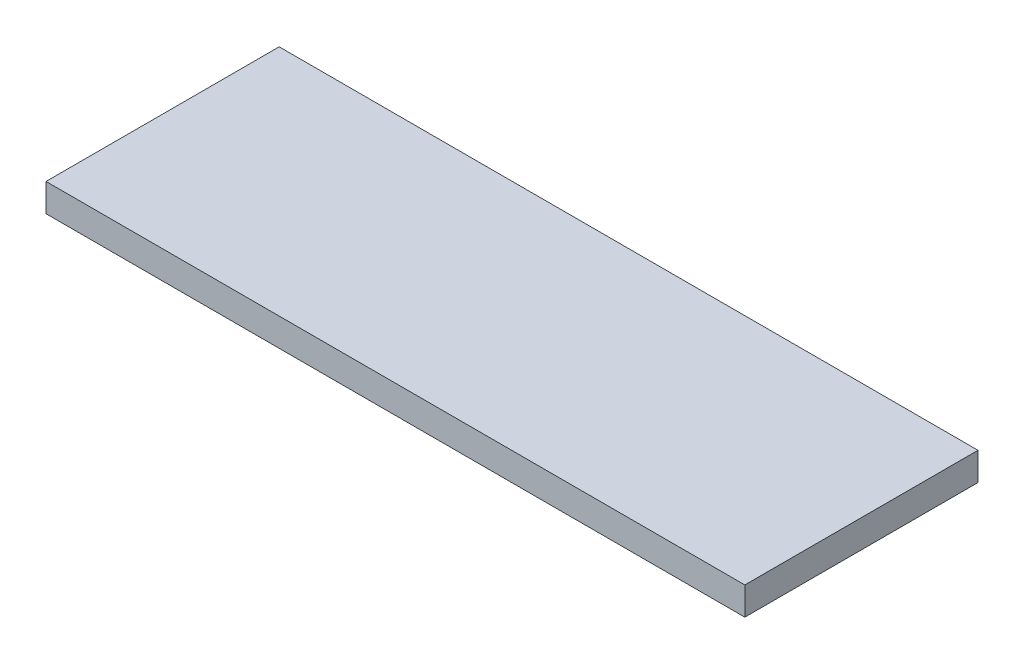
ISO-10303-21;
HEADER;
FILE_DESCRIPTION(('STEP AP214'),'2;1');
FILE_NAME('part.step','',(''),(''),'','','');
FILE_SCHEMA(('AUTOMOTIVE_DESIGN { 1 0 10303 214 1 1 1 1 }'));
ENDSEC;
DATA;
#1=APPLICATION_CONTEXT('core data for automotive mechanical design processes');
#2=APPLICATION_PROTOCOL_DEFINITION('international standard','automotive_design',2000,#1);
#3=PRODUCT_CONTEXT('',#1,'mechanical');
#4=PRODUCT('Part','Part','',(#3));
#5=PRODUCT_RELATED_PRODUCT_CATEGORY('part','',(#4));
#6=PRODUCT_DEFINITION_FORMATION('','',#4);
#7=PRODUCT_DEFINITION_CONTEXT('part definition',#1,'design');
#8=PRODUCT_DEFINITION('design','',#6,#7);
#9=PRODUCT_DEFINITION_SHAPE('','',#8);
#10=(LENGTH_UNIT() NAMED_UNIT(*) SI_UNIT(.MILLI.,.METRE.));
#11=(NAMED_UNIT(*) PLANE_ANGLE_UNIT() SI_UNIT($,.RADIAN.));
#12=(NAMED_UNIT(*) SI_UNIT($,.STERADIAN.) SOLID_ANGLE_UNIT());
#13=UNCERTAINTY_MEASURE_WITH_UNIT(LENGTH_MEASURE(1.E-05),#10,'distance_accuracy_value','');
#14=(GEOMETRIC_REPRESENTATION_CONTEXT(3) GLOBAL_UNCERTAINTY_ASSIGNED_CONTEXT((#13)) GLOBAL_UNIT_ASSIGNED_CONTEXT((#10,
#11,#12)) REPRESENTATION_CONTEXT('',''));
#15=CARTESIAN_POINT('',(0.,0.,0.));
#16=DIRECTION('',(0.,0.,1.));
#17=DIRECTION('',(1.,0.,0.));
#18=AXIS2_PLACEMENT_3D('',#15,#16,#17);
#19=CARTESIAN_POINT('',(0.,6.,0.));
#20=DIRECTION('',(-1.,0.,0.));
#21=DIRECTION('',(0.,0.,1.));
#22=AXIS2_PLACEMENT_3D('',#19,#20,#21);
#23=PLANE('',#22);
#24=DIRECTION('',(0.,0.,-1.));
#25=VECTOR('',#24,1.);
#26=CARTESIAN_POINT('',(0.,0.,0.));
#27=LINE('',#26,#25);
#28=CARTESIAN_POINT('',(0.,0.,0.));
#29=VERTEX_POINT('',#28);
#30=CARTESIAN_POINT('',(0.,0.,-50.05));
#31=VERTEX_POINT('',#30);
#32=EDGE_CURVE('E107',#29,#31,#27,.T.);
#33=ORIENTED_EDGE('',*,*,#32,.T.);
#34=DIRECTION('',(0.,-1.,0.));
#35=VECTOR('',#34,1.);
#36=CARTESIAN_POINT('',(0.,6.,-50.05));
#37=LINE('',#36,#35);
#38=CARTESIAN_POINT('',(0.,6.,-50.05));
#39=VERTEX_POINT('',#38);
#40=EDGE_CURVE('E11',#39,#31,#37,.T.);
#41=ORIENTED_EDGE('',*,*,#40,.F.);
#42=DIRECTION('',(0.,0.,-1.));
#43=VECTOR('',#42,1.);
#44=CARTESIAN_POINT('',(0.,6.,0.));
#45=LINE('',#44,#43);
#46=CARTESIAN_POINT('',(0.,6.,0.));
#47=VERTEX_POINT('',#46);
#48=EDGE_CURVE('E91',#47,#39,#45,.T.);
#49=ORIENTED_EDGE('',*,*,#48,.F.);
#50=DIRECTION('',(0.,-1.,0.));
#51=VECTOR('',#50,1.);
#52=CARTESIAN_POINT('',(0.,6.,0.));
#53=LINE('',#52,#51);
#54=EDGE_CURVE('E103',#47,#29,#53,.T.);
#55=ORIENTED_EDGE('',*,*,#54,.T.);
#56=EDGE_LOOP('',(#33,#41,#49,#55));
#57=FACE_BOUND('',#56,.T.);
#58=ADVANCED_FACE('F39',(#57),#23,.F.);
#59=CARTESIAN_POINT('',(0.,6.,-50.05));
#60=DIRECTION('',(0.,0.,1.));
#61=DIRECTION('',(1.,0.,0.));
#62=AXIS2_PLACEMENT_3D('',#59,#60,#61);
#63=PLANE('',#62);
#64=DIRECTION('',(-1.,0.,0.));
#65=VECTOR('',#64,1.);
#66=CARTESIAN_POINT('',(0.,0.,-50.05));
#67=LINE('',#66,#65);
#68=CARTESIAN_POINT('',(-150.,0.,-50.05));
#69=VERTEX_POINT('',#68);
#70=EDGE_CURVE('E96',#31,#69,#67,.T.);
#71=ORIENTED_EDGE('',*,*,#70,.T.);
#72=DIRECTION('',(0.,-1.,0.));
#73=VECTOR('',#72,1.);
#74=CARTESIAN_POINT('',(-150.,6.,-50.05));
#75=LINE('',#74,#73);
#76=CARTESIAN_POINT('',(-150.,6.,-50.05));
#77=VERTEX_POINT('',#76);
#78=EDGE_CURVE('E48',#77,#69,#75,.T.);
#79=ORIENTED_EDGE('',*,*,#78,.F.);
#80=DIRECTION('',(-1.,0.,0.));
#81=VECTOR('',#80,1.);
#82=CARTESIAN_POINT('',(0.,6.,-50.05));
#83=LINE('',#82,#81);
#84=EDGE_CURVE('E86',#39,#77,#83,.T.);
#85=ORIENTED_EDGE('',*,*,#84,.F.);
#86=ORIENTED_EDGE('',*,*,#40,.T.);
#87=EDGE_LOOP('',(#71,#79,#85,#86));
#88=FACE_BOUND('',#87,.T.);
#89=ADVANCED_FACE('F95',(#88),#63,.F.);
#90=CARTESIAN_POINT('',(-150.,6.,0.));
#91=DIRECTION('',(1.,0.,0.));
#92=DIRECTION('',(0.,0.,-1.));
#93=AXIS2_PLACEMENT_3D('',#90,#91,#92);
#94=PLANE('',#93);
#95=DIRECTION('',(0.,0.,1.));
#96=VECTOR('',#95,1.);
#97=CARTESIAN_POINT('',(-150.,0.,0.));
#98=LINE('',#97,#96);
#99=CARTESIAN_POINT('',(-150.,0.,0.));
#100=VERTEX_POINT('',#99);
#101=EDGE_CURVE('E73',#69,#100,#98,.T.);
#102=ORIENTED_EDGE('',*,*,#101,.T.);
#103=DIRECTION('',(0.,-1.,0.));
#104=VECTOR('',#103,1.);
#105=CARTESIAN_POINT('',(-150.,6.,0.));
#106=LINE('',#105,#104);
#107=CARTESIAN_POINT('',(-150.,6.,0.));
#108=VERTEX_POINT('',#107);
#109=EDGE_CURVE('E98',#108,#100,#106,.T.);
#110=ORIENTED_EDGE('',*,*,#109,.F.);
#111=DIRECTION('',(0.,0.,1.));
#112=VECTOR('',#111,1.);
#113=CARTESIAN_POINT('',(-150.,6.,0.));
#114=LINE('',#113,#112);
#115=EDGE_CURVE('E89',#77,#108,#114,.T.);
#116=ORIENTED_EDGE('',*,*,#115,.F.);
#117=ORIENTED_EDGE('',*,*,#78,.T.);
#118=EDGE_LOOP('',(#102,#110,#116,#117));
#119=FACE_BOUND('',#118,.T.);
#120=ADVANCED_FACE('F99',(#119),#94,.F.);
#121=CARTESIAN_POINT('',(0.,6.,0.));
#122=DIRECTION('',(0.,0.,-1.));
#123=DIRECTION('',(-1.,0.,0.));
#124=AXIS2_PLACEMENT_3D('',#121,#122,#123);
#125=PLANE('',#124);
#126=DIRECTION('',(1.,0.,0.));
#127=VECTOR('',#126,1.);
#128=CARTESIAN_POINT('',(0.,0.,0.));
#129=LINE('',#128,#127);
#130=EDGE_CURVE('E79',#100,#29,#129,.T.);
#131=ORIENTED_EDGE('',*,*,#130,.T.);
#132=ORIENTED_EDGE('',*,*,#54,.F.);
#133=DIRECTION('',(1.,0.,0.));
#134=VECTOR('',#133,1.);
#135=CARTESIAN_POINT('',(0.,6.,0.));
#136=LINE('',#135,#134);
#137=EDGE_CURVE('E56',#108,#47,#136,.T.);
#138=ORIENTED_EDGE('',*,*,#137,.F.);
#139=ORIENTED_EDGE('',*,*,#109,.T.);
#140=EDGE_LOOP('',(#131,#132,#138,#139));
#141=FACE_BOUND('',#140,.T.);
#142=ADVANCED_FACE('F120',(#141),#125,.F.);
#143=CARTESIAN_POINT('',(0.,6.,0.));
#144=DIRECTION('',(0.,1.,0.));
#145=DIRECTION('',(0.,0.,1.));
#146=AXIS2_PLACEMENT_3D('',#143,#144,#145);
#147=PLANE('',#146);
#148=ORIENTED_EDGE('',*,*,#48,.T.);
#149=ORIENTED_EDGE('',*,*,#84,.T.);
#150=ORIENTED_EDGE('',*,*,#115,.T.);
#151=ORIENTED_EDGE('',*,*,#137,.T.);
#152=EDGE_LOOP('',(#148,#149,#150,#151));
#153=FACE_BOUND('',#152,.T.);
#154=ADVANCED_FACE('F87',(#153),#147,.T.);
#155=CARTESIAN_POINT('',(0.,0.,0.));
#156=DIRECTION('',(0.,1.,0.));
#157=DIRECTION('',(0.,0.,1.));
#158=AXIS2_PLACEMENT_3D('',#155,#156,#157);
#159=PLANE('',#158);
#160=ORIENTED_EDGE('',*,*,#32,.F.);
#161=ORIENTED_EDGE('',*,*,#130,.F.);
#162=ORIENTED_EDGE('',*,*,#101,.F.);
#163=ORIENTED_EDGE('',*,*,#70,.F.);
#164=EDGE_LOOP('',(#160,#161,#162,#163));
#165=FACE_BOUND('',#164,.T.);
#166=ADVANCED_FACE('F123',(#165),#159,.F.);
#167=CLOSED_SHELL('',(#58,#89,#120,#142,#154,#166));
#168=MANIFOLD_SOLID_BREP('B2',#167);
#169=ADVANCED_BREP_SHAPE_REPRESENTATION('',(#18,#168),#14);
#170=SHAPE_DEFINITION_REPRESENTATION(#9,#169);
ENDSEC;
END-ISO-10303-21;
